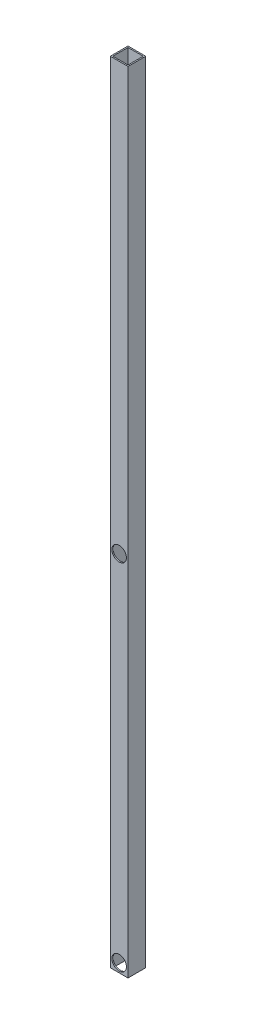
ISO-10303-21;
HEADER;
FILE_DESCRIPTION(('STEP AP214'),'2;1');
FILE_NAME('part.step','',(''),(''),'','','');
FILE_SCHEMA(('AUTOMOTIVE_DESIGN { 1 0 10303 214 1 1 1 1 }'));
ENDSEC;
DATA;
#1=APPLICATION_CONTEXT('core data for automotive mechanical design processes');
#2=APPLICATION_PROTOCOL_DEFINITION('international standard','automotive_design',2000,#1);
#3=PRODUCT_CONTEXT('',#1,'mechanical');
#4=PRODUCT('Part','Part','',(#3));
#5=PRODUCT_RELATED_PRODUCT_CATEGORY('part','',(#4));
#6=PRODUCT_DEFINITION_FORMATION('','',#4);
#7=PRODUCT_DEFINITION_CONTEXT('part definition',#1,'design');
#8=PRODUCT_DEFINITION('design','',#6,#7);
#9=PRODUCT_DEFINITION_SHAPE('','',#8);
#10=(LENGTH_UNIT() NAMED_UNIT(*) SI_UNIT(.MILLI.,.METRE.));
#11=(NAMED_UNIT(*) PLANE_ANGLE_UNIT() SI_UNIT($,.RADIAN.));
#12=(NAMED_UNIT(*) SI_UNIT($,.STERADIAN.) SOLID_ANGLE_UNIT());
#13=UNCERTAINTY_MEASURE_WITH_UNIT(LENGTH_MEASURE(1.E-05),#10,'distance_accuracy_value','');
#14=(GEOMETRIC_REPRESENTATION_CONTEXT(3) GLOBAL_UNCERTAINTY_ASSIGNED_CONTEXT((#13)) GLOBAL_UNIT_ASSIGNED_CONTEXT((#10,
#11,#12)) REPRESENTATION_CONTEXT('',''));
#15=CARTESIAN_POINT('',(0.,0.,0.));
#16=DIRECTION('',(0.,0.,1.));
#17=DIRECTION('',(1.,0.,0.));
#18=AXIS2_PLACEMENT_3D('',#15,#16,#17);
#19=CARTESIAN_POINT('',(0.,1981.2,0.));
#20=DIRECTION('',(0.,-1.,0.));
#21=DIRECTION('',(0.,0.,-1.));
#22=AXIS2_PLACEMENT_3D('',#19,#20,#21);
#23=PLANE('',#22);
#24=DIRECTION('',(0.,0.,1.));
#25=VECTOR('',#24,1.);
#26=CARTESIAN_POINT('',(0.,1981.2,0.));
#27=LINE('',#26,#25);
#28=CARTESIAN_POINT('',(0.,1981.2,-44.45));
#29=VERTEX_POINT('',#28);
#30=CARTESIAN_POINT('',(0.,1981.2,0.));
#31=VERTEX_POINT('',#30);
#32=EDGE_CURVE('E135',#29,#31,#27,.T.);
#33=ORIENTED_EDGE('',*,*,#32,.T.);
#34=DIRECTION('',(1.,0.,0.));
#35=VECTOR('',#34,1.);
#36=CARTESIAN_POINT('',(0.,1981.2,0.));
#37=LINE('',#36,#35);
#38=CARTESIAN_POINT('',(44.45,1981.2,0.));
#39=VERTEX_POINT('',#38);
#40=EDGE_CURVE('E138',#31,#39,#37,.T.);
#41=ORIENTED_EDGE('',*,*,#40,.T.);
#42=DIRECTION('',(0.,0.,-1.));
#43=VECTOR('',#42,1.);
#44=CARTESIAN_POINT('',(44.45,1981.2,0.));
#45=LINE('',#44,#43);
#46=CARTESIAN_POINT('',(44.45,1981.2,-44.45));
#47=VERTEX_POINT('',#46);
#48=EDGE_CURVE('E141',#39,#47,#45,.T.);
#49=ORIENTED_EDGE('',*,*,#48,.T.);
#50=DIRECTION('',(-1.,0.,0.));
#51=VECTOR('',#50,1.);
#52=CARTESIAN_POINT('',(0.,1981.2,-44.45));
#53=LINE('',#52,#51);
#54=EDGE_CURVE('E143',#47,#29,#53,.T.);
#55=ORIENTED_EDGE('',*,*,#54,.T.);
#56=EDGE_LOOP('',(#33,#41,#49,#55));
#57=FACE_BOUND('',#56,.T.);
#58=DIRECTION('',(1.,0.,0.));
#59=VECTOR('',#58,1.);
#60=CARTESIAN_POINT('',(3.175,1981.2,-3.175));
#61=LINE('',#60,#59);
#62=CARTESIAN_POINT('',(3.175,1981.2,-3.175));
#63=VERTEX_POINT('',#62);
#64=CARTESIAN_POINT('',(41.275,1981.2,-3.175));
#65=VERTEX_POINT('',#64);
#66=EDGE_CURVE('E97',#63,#65,#61,.T.);
#67=ORIENTED_EDGE('',*,*,#66,.F.);
#68=DIRECTION('',(0.,0.,1.));
#69=VECTOR('',#68,1.);
#70=CARTESIAN_POINT('',(3.175,1981.2,-3.175));
#71=LINE('',#70,#69);
#72=CARTESIAN_POINT('',(3.175,1981.2,-41.275));
#73=VERTEX_POINT('',#72);
#74=EDGE_CURVE('E119',#73,#63,#71,.T.);
#75=ORIENTED_EDGE('',*,*,#74,.F.);
#76=DIRECTION('',(-1.,0.,0.));
#77=VECTOR('',#76,1.);
#78=CARTESIAN_POINT('',(3.175,1981.2,-41.275));
#79=LINE('',#78,#77);
#80=CARTESIAN_POINT('',(41.275,1981.2,-41.275));
#81=VERTEX_POINT('',#80);
#82=EDGE_CURVE('E117',#81,#73,#79,.T.);
#83=ORIENTED_EDGE('',*,*,#82,.F.);
#84=DIRECTION('',(0.,0.,-1.));
#85=VECTOR('',#84,1.);
#86=CARTESIAN_POINT('',(41.275,1981.2,-3.175));
#87=LINE('',#86,#85);
#88=EDGE_CURVE('E105',#65,#81,#87,.T.);
#89=ORIENTED_EDGE('',*,*,#88,.F.);
#90=EDGE_LOOP('',(#67,#75,#83,#89));
#91=FACE_BOUND('',#90,.T.);
#92=ADVANCED_FACE('F32',(#57,#91),#23,.F.);
#93=CARTESIAN_POINT('',(0.,0.,0.));
#94=DIRECTION('',(0.,-1.,0.));
#95=DIRECTION('',(0.,0.,-1.));
#96=AXIS2_PLACEMENT_3D('',#93,#94,#95);
#97=PLANE('',#96);
#98=DIRECTION('',(0.,0.,1.));
#99=VECTOR('',#98,1.);
#100=CARTESIAN_POINT('',(0.,0.,0.));
#101=LINE('',#100,#99);
#102=CARTESIAN_POINT('',(0.,0.,-44.45));
#103=VERTEX_POINT('',#102);
#104=CARTESIAN_POINT('',(0.,0.,0.));
#105=VERTEX_POINT('',#104);
#106=EDGE_CURVE('E113',#103,#105,#101,.T.);
#107=ORIENTED_EDGE('',*,*,#106,.F.);
#108=DIRECTION('',(-1.,0.,0.));
#109=VECTOR('',#108,1.);
#110=CARTESIAN_POINT('',(0.,0.,-44.45));
#111=LINE('',#110,#109);
#112=CARTESIAN_POINT('',(44.45,0.,-44.45));
#113=VERTEX_POINT('',#112);
#114=EDGE_CURVE('E139',#113,#103,#111,.T.);
#115=ORIENTED_EDGE('',*,*,#114,.F.);
#116=DIRECTION('',(0.,0.,-1.));
#117=VECTOR('',#116,1.);
#118=CARTESIAN_POINT('',(44.45,0.,0.));
#119=LINE('',#118,#117);
#120=CARTESIAN_POINT('',(44.45,0.,0.));
#121=VERTEX_POINT('',#120);
#122=EDGE_CURVE('E150',#121,#113,#119,.T.);
#123=ORIENTED_EDGE('',*,*,#122,.F.);
#124=DIRECTION('',(1.,0.,0.));
#125=VECTOR('',#124,1.);
#126=CARTESIAN_POINT('',(0.,0.,0.));
#127=LINE('',#126,#125);
#128=EDGE_CURVE('E148',#105,#121,#127,.T.);
#129=ORIENTED_EDGE('',*,*,#128,.F.);
#130=EDGE_LOOP('',(#107,#115,#123,#129));
#131=FACE_BOUND('',#130,.T.);
#132=DIRECTION('',(0.,0.,1.));
#133=VECTOR('',#132,1.);
#134=CARTESIAN_POINT('',(3.175,0.,-3.175));
#135=LINE('',#134,#133);
#136=CARTESIAN_POINT('',(3.175,0.,-41.275));
#137=VERTEX_POINT('',#136);
#138=CARTESIAN_POINT('',(3.175,0.,-3.175));
#139=VERTEX_POINT('',#138);
#140=EDGE_CURVE('E106',#137,#139,#135,.T.);
#141=ORIENTED_EDGE('',*,*,#140,.T.);
#142=DIRECTION('',(1.,0.,0.));
#143=VECTOR('',#142,1.);
#144=CARTESIAN_POINT('',(3.175,0.,-3.175));
#145=LINE('',#144,#143);
#146=CARTESIAN_POINT('',(41.275,0.,-3.175));
#147=VERTEX_POINT('',#146);
#148=EDGE_CURVE('E55',#139,#147,#145,.T.);
#149=ORIENTED_EDGE('',*,*,#148,.T.);
#150=DIRECTION('',(0.,0.,-1.));
#151=VECTOR('',#150,1.);
#152=CARTESIAN_POINT('',(41.275,0.,-3.175));
#153=LINE('',#152,#151);
#154=CARTESIAN_POINT('',(41.275,0.,-41.275));
#155=VERTEX_POINT('',#154);
#156=EDGE_CURVE('E112',#147,#155,#153,.T.);
#157=ORIENTED_EDGE('',*,*,#156,.T.);
#158=DIRECTION('',(-1.,0.,0.));
#159=VECTOR('',#158,1.);
#160=CARTESIAN_POINT('',(3.175,0.,-41.275));
#161=LINE('',#160,#159);
#162=EDGE_CURVE('E127',#155,#137,#161,.T.);
#163=ORIENTED_EDGE('',*,*,#162,.T.);
#164=EDGE_LOOP('',(#141,#149,#157,#163));
#165=FACE_BOUND('',#164,.T.);
#166=ADVANCED_FACE('F168',(#131,#165),#97,.T.);
#167=CARTESIAN_POINT('',(0.,1981.2,0.));
#168=DIRECTION('',(1.,0.,0.));
#169=DIRECTION('',(0.,0.,-1.));
#170=AXIS2_PLACEMENT_3D('',#167,#168,#169);
#171=PLANE('',#170);
#172=ORIENTED_EDGE('',*,*,#106,.T.);
#173=DIRECTION('',(0.,-1.,0.));
#174=VECTOR('',#173,1.);
#175=CARTESIAN_POINT('',(0.,1981.2,0.));
#176=LINE('',#175,#174);
#177=EDGE_CURVE('E11',#31,#105,#176,.T.);
#178=ORIENTED_EDGE('',*,*,#177,.F.);
#179=ORIENTED_EDGE('',*,*,#32,.F.);
#180=DIRECTION('',(0.,-1.,0.));
#181=VECTOR('',#180,1.);
#182=CARTESIAN_POINT('',(0.,1981.2,-44.45));
#183=LINE('',#182,#181);
#184=EDGE_CURVE('E145',#29,#103,#183,.T.);
#185=ORIENTED_EDGE('',*,*,#184,.T.);
#186=EDGE_LOOP('',(#172,#178,#179,#185));
#187=FACE_BOUND('',#186,.T.);
#188=ADVANCED_FACE('F34',(#187),#171,.F.);
#189=CARTESIAN_POINT('',(0.,1981.2,0.));
#190=DIRECTION('',(0.,0.,-1.));
#191=DIRECTION('',(-1.,0.,0.));
#192=AXIS2_PLACEMENT_3D('',#189,#190,#191);
#193=PLANE('',#192);
#194=CARTESIAN_POINT('',(22.225,22.225,0.));
#195=DIRECTION('',(0.,0.,1.));
#196=DIRECTION('',(1.,0.,0.));
#197=AXIS2_PLACEMENT_3D('',#194,#195,#196);
#198=CIRCLE('',#197,18.25625);
#199=CARTESIAN_POINT('',(40.48125,22.225,0.));
#200=VERTEX_POINT('',#199);
#201=EDGE_CURVE('E125',#200,#200,#198,.T.);
#202=ORIENTED_EDGE('',*,*,#201,.F.);
#203=EDGE_LOOP('',(#202));
#204=FACE_BOUND('',#203,.T.);
#205=CARTESIAN_POINT('',(22.225,911.225,0.));
#206=DIRECTION('',(0.,0.,1.));
#207=DIRECTION('',(1.,0.,0.));
#208=AXIS2_PLACEMENT_3D('',#205,#206,#207);
#209=CIRCLE('',#208,18.25625);
#210=CARTESIAN_POINT('',(40.48125,911.225,0.));
#211=VERTEX_POINT('',#210);
#212=EDGE_CURVE('E223',#211,#211,#209,.T.);
#213=ORIENTED_EDGE('',*,*,#212,.F.);
#214=EDGE_LOOP('',(#213));
#215=FACE_BOUND('',#214,.T.);
#216=ORIENTED_EDGE('',*,*,#128,.T.);
#217=DIRECTION('',(0.,-1.,0.));
#218=VECTOR('',#217,1.);
#219=CARTESIAN_POINT('',(44.45,1981.2,0.));
#220=LINE('',#219,#218);
#221=EDGE_CURVE('E40',#39,#121,#220,.T.);
#222=ORIENTED_EDGE('',*,*,#221,.F.);
#223=ORIENTED_EDGE('',*,*,#40,.F.);
#224=ORIENTED_EDGE('',*,*,#177,.T.);
#225=EDGE_LOOP('',(#216,#222,#223,#224));
#226=FACE_BOUND('',#225,.T.);
#227=ADVANCED_FACE('F178',(#204,#215,#226),#193,.F.);
#228=CARTESIAN_POINT('',(44.45,1981.2,0.));
#229=DIRECTION('',(-1.,0.,0.));
#230=DIRECTION('',(0.,0.,1.));
#231=AXIS2_PLACEMENT_3D('',#228,#229,#230);
#232=PLANE('',#231);
#233=ORIENTED_EDGE('',*,*,#122,.T.);
#234=DIRECTION('',(0.,-1.,0.));
#235=VECTOR('',#234,1.);
#236=CARTESIAN_POINT('',(44.45,1981.2,-44.45));
#237=LINE('',#236,#235);
#238=EDGE_CURVE('E155',#47,#113,#237,.T.);
#239=ORIENTED_EDGE('',*,*,#238,.F.);
#240=ORIENTED_EDGE('',*,*,#48,.F.);
#241=ORIENTED_EDGE('',*,*,#221,.T.);
#242=EDGE_LOOP('',(#233,#239,#240,#241));
#243=FACE_BOUND('',#242,.T.);
#244=ADVANCED_FACE('F162',(#243),#232,.F.);
#245=CARTESIAN_POINT('',(0.,1981.2,-44.45));
#246=DIRECTION('',(0.,0.,1.));
#247=DIRECTION('',(1.,0.,0.));
#248=AXIS2_PLACEMENT_3D('',#245,#246,#247);
#249=PLANE('',#248);
#250=CARTESIAN_POINT('',(22.225,911.225,-44.45));
#251=DIRECTION('',(0.,0.,-1.));
#252=DIRECTION('',(-1.,0.,0.));
#253=AXIS2_PLACEMENT_3D('',#250,#251,#252);
#254=CIRCLE('',#253,12.7);
#255=CARTESIAN_POINT('',(9.525,911.225,-44.45));
#256=VERTEX_POINT('',#255);
#257=EDGE_CURVE('E206',#256,#256,#254,.T.);
#258=ORIENTED_EDGE('',*,*,#257,.F.);
#259=EDGE_LOOP('',(#258));
#260=FACE_BOUND('',#259,.T.);
#261=CARTESIAN_POINT('',(22.225,22.225,-44.45));
#262=DIRECTION('',(0.,0.,-1.));
#263=DIRECTION('',(-1.,0.,0.));
#264=AXIS2_PLACEMENT_3D('',#261,#262,#263);
#265=CIRCLE('',#264,12.7);
#266=CARTESIAN_POINT('',(9.525,22.225,-44.45));
#267=VERTEX_POINT('',#266);
#268=EDGE_CURVE('E209',#267,#267,#265,.T.);
#269=ORIENTED_EDGE('',*,*,#268,.F.);
#270=EDGE_LOOP('',(#269));
#271=FACE_BOUND('',#270,.T.);
#272=ORIENTED_EDGE('',*,*,#114,.T.);
#273=ORIENTED_EDGE('',*,*,#184,.F.);
#274=ORIENTED_EDGE('',*,*,#54,.F.);
#275=ORIENTED_EDGE('',*,*,#238,.T.);
#276=EDGE_LOOP('',(#272,#273,#274,#275));
#277=FACE_BOUND('',#276,.T.);
#278=ADVANCED_FACE('F172',(#260,#271,#277),#249,.F.);
#279=CARTESIAN_POINT('',(3.175,1981.2,-3.175));
#280=DIRECTION('',(0.,0.,-1.));
#281=DIRECTION('',(-1.,0.,0.));
#282=AXIS2_PLACEMENT_3D('',#279,#280,#281);
#283=PLANE('',#282);
#284=CARTESIAN_POINT('',(22.225,22.225,-3.175));
#285=DIRECTION('',(0.,0.,-1.));
#286=DIRECTION('',(-1.,0.,0.));
#287=AXIS2_PLACEMENT_3D('',#284,#285,#286);
#288=CIRCLE('',#287,18.25625);
#289=CARTESIAN_POINT('',(3.96875,22.225,-3.175));
#290=VERTEX_POINT('',#289);
#291=EDGE_CURVE('E220',#290,#290,#288,.F.);
#292=ORIENTED_EDGE('',*,*,#291,.T.);
#293=EDGE_LOOP('',(#292));
#294=FACE_BOUND('',#293,.T.);
#295=CARTESIAN_POINT('',(22.225,911.225,-3.175));
#296=DIRECTION('',(0.,0.,-1.));
#297=DIRECTION('',(-1.,0.,0.));
#298=AXIS2_PLACEMENT_3D('',#295,#296,#297);
#299=CIRCLE('',#298,18.25625);
#300=CARTESIAN_POINT('',(3.96875,911.225,-3.175));
#301=VERTEX_POINT('',#300);
#302=EDGE_CURVE('E226',#301,#301,#299,.F.);
#303=ORIENTED_EDGE('',*,*,#302,.T.);
#304=EDGE_LOOP('',(#303));
#305=FACE_BOUND('',#304,.T.);
#306=ORIENTED_EDGE('',*,*,#148,.F.);
#307=DIRECTION('',(0.,-1.,0.));
#308=VECTOR('',#307,1.);
#309=CARTESIAN_POINT('',(3.175,1981.2,-3.175));
#310=LINE('',#309,#308);
#311=EDGE_CURVE('E101',#63,#139,#310,.T.);
#312=ORIENTED_EDGE('',*,*,#311,.F.);
#313=ORIENTED_EDGE('',*,*,#66,.T.);
#314=DIRECTION('',(0.,-1.,0.));
#315=VECTOR('',#314,1.);
#316=CARTESIAN_POINT('',(41.275,1981.2,-3.175));
#317=LINE('',#316,#315);
#318=EDGE_CURVE('E100',#65,#147,#317,.T.);
#319=ORIENTED_EDGE('',*,*,#318,.T.);
#320=EDGE_LOOP('',(#306,#312,#313,#319));
#321=FACE_BOUND('',#320,.T.);
#322=ADVANCED_FACE('F99',(#294,#305,#321),#283,.T.);
#323=CARTESIAN_POINT('',(41.275,1981.2,-3.175));
#324=DIRECTION('',(-1.,0.,0.));
#325=DIRECTION('',(0.,0.,1.));
#326=AXIS2_PLACEMENT_3D('',#323,#324,#325);
#327=PLANE('',#326);
#328=ORIENTED_EDGE('',*,*,#156,.F.);
#329=ORIENTED_EDGE('',*,*,#318,.F.);
#330=ORIENTED_EDGE('',*,*,#88,.T.);
#331=DIRECTION('',(0.,-1.,0.));
#332=VECTOR('',#331,1.);
#333=CARTESIAN_POINT('',(41.275,1981.2,-41.275));
#334=LINE('',#333,#332);
#335=EDGE_CURVE('E114',#81,#155,#334,.T.);
#336=ORIENTED_EDGE('',*,*,#335,.T.);
#337=EDGE_LOOP('',(#328,#329,#330,#336));
#338=FACE_BOUND('',#337,.T.);
#339=ADVANCED_FACE('F109',(#338),#327,.T.);
#340=CARTESIAN_POINT('',(3.175,1981.2,-41.275));
#341=DIRECTION('',(0.,0.,1.));
#342=DIRECTION('',(1.,0.,0.));
#343=AXIS2_PLACEMENT_3D('',#340,#341,#342);
#344=PLANE('',#343);
#345=CARTESIAN_POINT('',(22.225,911.225,-41.275));
#346=DIRECTION('',(0.,0.,1.));
#347=DIRECTION('',(1.,0.,0.));
#348=AXIS2_PLACEMENT_3D('',#345,#346,#347);
#349=CIRCLE('',#348,12.7);
#350=CARTESIAN_POINT('',(34.925,911.225,-41.275));
#351=VERTEX_POINT('',#350);
#352=EDGE_CURVE('E211',#351,#351,#349,.F.);
#353=ORIENTED_EDGE('',*,*,#352,.T.);
#354=EDGE_LOOP('',(#353));
#355=FACE_BOUND('',#354,.T.);
#356=CARTESIAN_POINT('',(22.225,22.225,-41.275));
#357=DIRECTION('',(0.,0.,1.));
#358=DIRECTION('',(1.,0.,0.));
#359=AXIS2_PLACEMENT_3D('',#356,#357,#358);
#360=CIRCLE('',#359,12.7);
#361=CARTESIAN_POINT('',(34.925,22.225,-41.275));
#362=VERTEX_POINT('',#361);
#363=EDGE_CURVE('E212',#362,#362,#360,.F.);
#364=ORIENTED_EDGE('',*,*,#363,.T.);
#365=EDGE_LOOP('',(#364));
#366=FACE_BOUND('',#365,.T.);
#367=ORIENTED_EDGE('',*,*,#162,.F.);
#368=ORIENTED_EDGE('',*,*,#335,.F.);
#369=ORIENTED_EDGE('',*,*,#82,.T.);
#370=DIRECTION('',(0.,-1.,0.));
#371=VECTOR('',#370,1.);
#372=CARTESIAN_POINT('',(3.175,1981.2,-41.275));
#373=LINE('',#372,#371);
#374=EDGE_CURVE('E47',#73,#137,#373,.T.);
#375=ORIENTED_EDGE('',*,*,#374,.T.);
#376=EDGE_LOOP('',(#367,#368,#369,#375));
#377=FACE_BOUND('',#376,.T.);
#378=ADVANCED_FACE('F244',(#355,#366,#377),#344,.T.);
#379=CARTESIAN_POINT('',(3.175,1981.2,-3.175));
#380=DIRECTION('',(1.,0.,0.));
#381=DIRECTION('',(0.,0.,-1.));
#382=AXIS2_PLACEMENT_3D('',#379,#380,#381);
#383=PLANE('',#382);
#384=ORIENTED_EDGE('',*,*,#140,.F.);
#385=ORIENTED_EDGE('',*,*,#374,.F.);
#386=ORIENTED_EDGE('',*,*,#74,.T.);
#387=ORIENTED_EDGE('',*,*,#311,.T.);
#388=EDGE_LOOP('',(#384,#385,#386,#387));
#389=FACE_BOUND('',#388,.T.);
#390=ADVANCED_FACE('F234',(#389),#383,.T.);
#391=CARTESIAN_POINT('',(22.225,911.225,-44.451));
#392=DIRECTION('',(0.,0.,1.));
#393=DIRECTION('',(1.,0.,0.));
#394=AXIS2_PLACEMENT_3D('',#391,#392,#393);
#395=CYLINDRICAL_SURFACE('',#394,18.25625);
#396=ORIENTED_EDGE('',*,*,#302,.F.);
#397=EDGE_LOOP('',(#396));
#398=FACE_BOUND('',#397,.T.);
#399=ORIENTED_EDGE('',*,*,#212,.T.);
#400=EDGE_LOOP('',(#399));
#401=FACE_BOUND('',#400,.T.);
#402=ADVANCED_FACE('F231',(#398,#401),#395,.F.);
#403=CARTESIAN_POINT('',(22.225,22.225,-44.451));
#404=DIRECTION('',(0.,0.,1.));
#405=DIRECTION('',(1.,0.,0.));
#406=AXIS2_PLACEMENT_3D('',#403,#404,#405);
#407=CYLINDRICAL_SURFACE('',#406,18.25625);
#408=ORIENTED_EDGE('',*,*,#291,.F.);
#409=EDGE_LOOP('',(#408));
#410=FACE_BOUND('',#409,.T.);
#411=ORIENTED_EDGE('',*,*,#201,.T.);
#412=EDGE_LOOP('',(#411));
#413=FACE_BOUND('',#412,.T.);
#414=ADVANCED_FACE('F233',(#410,#413),#407,.F.);
#415=CARTESIAN_POINT('',(22.225,22.225,0.001000000000001));
#416=DIRECTION('',(0.,0.,-1.));
#417=DIRECTION('',(-1.,0.,0.));
#418=AXIS2_PLACEMENT_3D('',#415,#416,#417);
#419=CYLINDRICAL_SURFACE('',#418,12.7);
#420=ORIENTED_EDGE('',*,*,#363,.F.);
#421=EDGE_LOOP('',(#420));
#422=FACE_BOUND('',#421,.T.);
#423=ORIENTED_EDGE('',*,*,#268,.T.);
#424=EDGE_LOOP('',(#423));
#425=FACE_BOUND('',#424,.T.);
#426=ADVANCED_FACE('F241',(#422,#425),#419,.F.);
#427=CARTESIAN_POINT('',(22.225,911.225,0.001000000000001));
#428=DIRECTION('',(0.,0.,-1.));
#429=DIRECTION('',(-1.,0.,0.));
#430=AXIS2_PLACEMENT_3D('',#427,#428,#429);
#431=CYLINDRICAL_SURFACE('',#430,12.7);
#432=ORIENTED_EDGE('',*,*,#352,.F.);
#433=EDGE_LOOP('',(#432));
#434=FACE_BOUND('',#433,.T.);
#435=ORIENTED_EDGE('',*,*,#257,.T.);
#436=EDGE_LOOP('',(#435));
#437=FACE_BOUND('',#436,.T.);
#438=ADVANCED_FACE('F317',(#434,#437),#431,.F.);
#439=CLOSED_SHELL('',(#92,#166,#188,#227,#244,#278,#322,#339,#378,#390,#402,#414,#426,#438));
#440=MANIFOLD_SOLID_BREP('B2',#439);
#441=ADVANCED_BREP_SHAPE_REPRESENTATION('',(#18,#440),#14);
#442=SHAPE_DEFINITION_REPRESENTATION(#9,#441);
ENDSEC;
END-ISO-10303-21;
